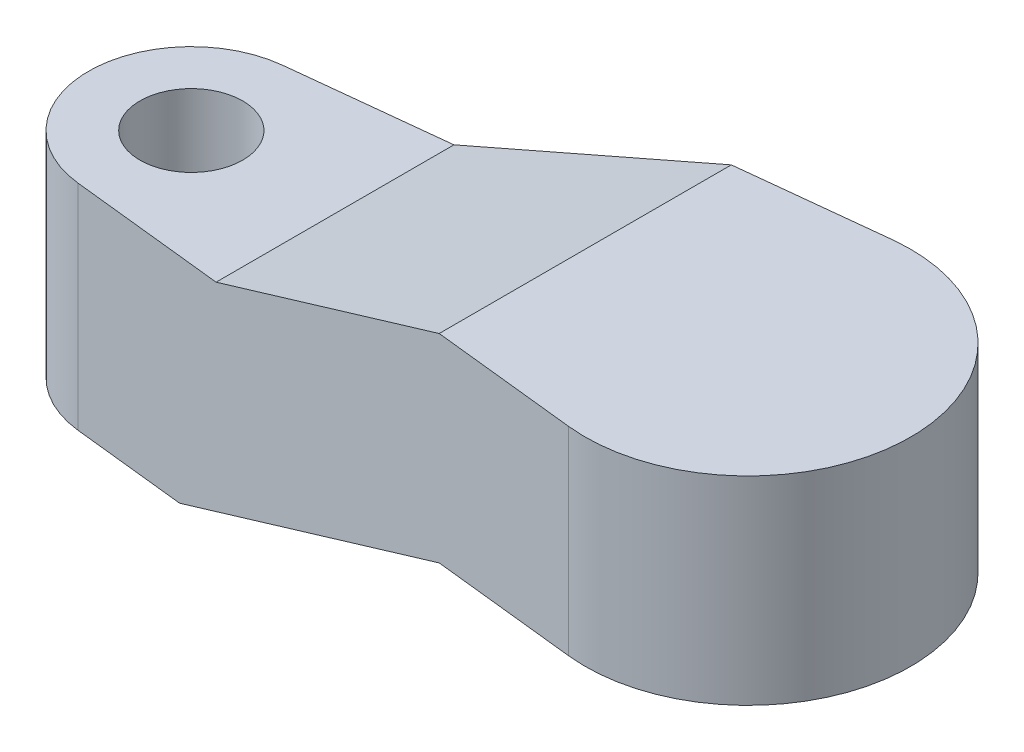
ISO-10303-21;
HEADER;
FILE_DESCRIPTION(('STEP AP214'),'2;1');
FILE_NAME('part.step','',(''),(''),'','','');
FILE_SCHEMA(('AUTOMOTIVE_DESIGN { 1 0 10303 214 1 1 1 1 }'));
ENDSEC;
DATA;
#1=APPLICATION_CONTEXT('core data for automotive mechanical design processes');
#2=APPLICATION_PROTOCOL_DEFINITION('international standard','automotive_design',2000,#1);
#3=PRODUCT_CONTEXT('',#1,'mechanical');
#4=PRODUCT('Part','Part','',(#3));
#5=PRODUCT_RELATED_PRODUCT_CATEGORY('part','',(#4));
#6=PRODUCT_DEFINITION_FORMATION('','',#4);
#7=PRODUCT_DEFINITION_CONTEXT('part definition',#1,'design');
#8=PRODUCT_DEFINITION('design','',#6,#7);
#9=PRODUCT_DEFINITION_SHAPE('','',#8);
#10=(LENGTH_UNIT() NAMED_UNIT(*) SI_UNIT(.MILLI.,.METRE.));
#11=(NAMED_UNIT(*) PLANE_ANGLE_UNIT() SI_UNIT($,.RADIAN.));
#12=(NAMED_UNIT(*) SI_UNIT($,.STERADIAN.) SOLID_ANGLE_UNIT());
#13=UNCERTAINTY_MEASURE_WITH_UNIT(LENGTH_MEASURE(1.E-05),#10,'distance_accuracy_value','');
#14=(GEOMETRIC_REPRESENTATION_CONTEXT(3) GLOBAL_UNCERTAINTY_ASSIGNED_CONTEXT((#13)) GLOBAL_UNIT_ASSIGNED_CONTEXT((#10,
#11,#12)) REPRESENTATION_CONTEXT('',''));
#15=CARTESIAN_POINT('',(0.,0.,0.));
#16=DIRECTION('',(0.,0.,1.));
#17=DIRECTION('',(1.,0.,0.));
#18=AXIS2_PLACEMENT_3D('',#15,#16,#17);
#19=CARTESIAN_POINT('',(-16.25,9.,0.));
#20=DIRECTION('',(0.,-1.,0.));
#21=DIRECTION('',(0.,0.,-1.));
#22=AXIS2_PLACEMENT_3D('',#19,#20,#21);
#23=CYLINDRICAL_SURFACE('',#22,3.);
#24=CARTESIAN_POINT('',(-16.25,6.25,0.));
#25=DIRECTION('',(0.,-1.,0.));
#26=DIRECTION('',(1.,0.,0.));
#27=AXIS2_PLACEMENT_3D('',#24,#25,#26);
#28=CIRCLE('',#27,3.);
#29=CARTESIAN_POINT('',(-16.5730769230769,6.25,2.98255281625911));
#30=VERTEX_POINT('',#29);
#31=CARTESIAN_POINT('',(-16.5730769230769,6.25,-2.98255281625911));
#32=VERTEX_POINT('',#31);
#33=EDGE_CURVE('E146',#30,#32,#28,.T.);
#34=ORIENTED_EDGE('',*,*,#33,.T.);
#35=DIRECTION('',(0.,-1.,0.));
#36=VECTOR('',#35,1.);
#37=CARTESIAN_POINT('',(-16.5730769230769,9.,-2.98255281625911));
#38=LINE('',#37,#36);
#39=CARTESIAN_POINT('',(-16.5730769230769,0.,-2.98255281625911));
#40=VERTEX_POINT('',#39);
#41=EDGE_CURVE('E129',#32,#40,#38,.T.);
#42=ORIENTED_EDGE('',*,*,#41,.T.);
#43=CARTESIAN_POINT('',(-16.25,0.,0.));
#44=DIRECTION('',(0.,1.,0.));
#45=DIRECTION('',(0.,0.,1.));
#46=AXIS2_PLACEMENT_3D('',#43,#44,#45);
#47=CIRCLE('',#46,3.);
#48=CARTESIAN_POINT('',(-16.5730769230769,0.,2.98255281625911));
#49=VERTEX_POINT('',#48);
#50=EDGE_CURVE('E120',#40,#49,#47,.T.);
#51=ORIENTED_EDGE('',*,*,#50,.T.);
#52=DIRECTION('',(0.,-1.,0.));
#53=VECTOR('',#52,1.);
#54=CARTESIAN_POINT('',(-16.5730769230769,9.,2.98255281625911));
#55=LINE('',#54,#53);
#56=EDGE_CURVE('E137',#30,#49,#55,.T.);
#57=ORIENTED_EDGE('',*,*,#56,.F.);
#58=EDGE_LOOP('',(#34,#42,#51,#57));
#59=FACE_BOUND('',#58,.T.);
#60=ADVANCED_FACE('F34',(#59),#23,.T.);
#61=CARTESIAN_POINT('',(-16.5730769230769,9.,2.98255281625911));
#62=DIRECTION('',(0.107692307692308,0.,-0.99418427208637));
#63=DIRECTION('',(-0.99418427208637,0.,-0.107692307692308));
#64=AXIS2_PLACEMENT_3D('',#61,#62,#63);
#65=PLANE('',#64);
#66=DIRECTION('',(0.99418427208637,0.,0.107692307692308));
#67=VECTOR('',#66,1.);
#68=CARTESIAN_POINT('',(-16.5730769230769,0.,2.98255281625911));
#69=LINE('',#68,#67);
#70=CARTESIAN_POINT('',(-13.25,0.,3.34251608718693));
#71=VERTEX_POINT('',#70);
#72=EDGE_CURVE('E122',#49,#71,#69,.T.);
#73=ORIENTED_EDGE('',*,*,#72,.T.);
#74=DIRECTION('',(0.931103612303157,0.350533124631777,0.10085926676263));
#75=VECTOR('',#74,1.);
#76=CARTESIAN_POINT('',(-13.2273149984071,0.0085402358937902,3.34497337829496));
#77=LINE('',#76,#75);
#78=CARTESIAN_POINT('',(-4.75,3.2,4.26325547231481));
#79=VERTEX_POINT('',#78);
#80=EDGE_CURVE('E49',#71,#79,#77,.T.);
#81=ORIENTED_EDGE('',*,*,#80,.T.);
#82=DIRECTION('',(0.99418427208637,0.,0.107692307692308));
#83=VECTOR('',#82,1.);
#84=CARTESIAN_POINT('',(-16.5730769230769,3.2,2.98255281625911));
#85=LINE('',#84,#83);
#86=CARTESIAN_POINT('',(-0.511538461538459,3.2,4.72237529241026));
#87=VERTEX_POINT('',#86);
#88=EDGE_CURVE('E174',#79,#87,#85,.T.);
#89=ORIENTED_EDGE('',*,*,#88,.T.);
#90=DIRECTION('',(0.,-1.,0.));
#91=VECTOR('',#90,1.);
#92=CARTESIAN_POINT('',(-0.511538461538459,9.,4.72237529241026));
#93=LINE('',#92,#91);
#94=CARTESIAN_POINT('',(-0.511538461538459,9.,4.72237529241026));
#95=VERTEX_POINT('',#94);
#96=EDGE_CURVE('E134',#95,#87,#93,.T.);
#97=ORIENTED_EDGE('',*,*,#96,.F.);
#98=DIRECTION('',(0.99418427208637,0.,0.107692307692308));
#99=VECTOR('',#98,1.);
#100=CARTESIAN_POINT('',(-16.5730769230769,9.,2.98255281625911));
#101=LINE('',#100,#99);
#102=CARTESIAN_POINT('',(-4.75,9.,4.26325547231481));
#103=VERTEX_POINT('',#102);
#104=EDGE_CURVE('E121',#103,#95,#101,.T.);
#105=ORIENTED_EDGE('',*,*,#104,.F.);
#106=DIRECTION('',(-0.931103612303157,-0.350533124631777,-0.10085926676263));
#107=VECTOR('',#106,1.);
#108=CARTESIAN_POINT('',(-15.1203344181512,5.09587410140191,3.13991719752199));
#109=LINE('',#108,#107);
#110=CARTESIAN_POINT('',(-12.0546875,6.25,3.47199506322054));
#111=VERTEX_POINT('',#110);
#112=EDGE_CURVE('E57',#103,#111,#109,.T.);
#113=ORIENTED_EDGE('',*,*,#112,.T.);
#114=DIRECTION('',(-0.99418427208637,0.,-0.107692307692308));
#115=VECTOR('',#114,1.);
#116=CARTESIAN_POINT('',(-16.5730769230769,6.25,2.98255281625911));
#117=LINE('',#116,#115);
#118=EDGE_CURVE('E152',#111,#30,#117,.T.);
#119=ORIENTED_EDGE('',*,*,#118,.T.);
#120=ORIENTED_EDGE('',*,*,#56,.T.);
#121=EDGE_LOOP('',(#73,#81,#89,#97,#105,#113,#119,#120));
#122=FACE_BOUND('',#121,.T.);
#123=ADVANCED_FACE('F173',(#122),#65,.F.);
#124=CARTESIAN_POINT('',(0.,9.,0.));
#125=DIRECTION('',(0.,-1.,0.));
#126=DIRECTION('',(0.,0.,-1.));
#127=AXIS2_PLACEMENT_3D('',#124,#125,#126);
#128=CYLINDRICAL_SURFACE('',#127,4.75);
#129=ORIENTED_EDGE('',*,*,#96,.T.);
#130=CARTESIAN_POINT('',(0.,3.2,0.));
#131=DIRECTION('',(0.,1.,0.));
#132=DIRECTION('',(0.,0.,1.));
#133=AXIS2_PLACEMENT_3D('',#130,#131,#132);
#134=CIRCLE('',#133,4.75);
#135=CARTESIAN_POINT('',(-0.511538461538463,3.2,-4.72237529241026));
#136=VERTEX_POINT('',#135);
#137=EDGE_CURVE('E167',#136,#87,#134,.F.);
#138=ORIENTED_EDGE('',*,*,#137,.F.);
#139=DIRECTION('',(0.,-1.,0.));
#140=VECTOR('',#139,1.);
#141=CARTESIAN_POINT('',(-0.511538461538461,9.,-4.72237529241026));
#142=LINE('',#141,#140);
#143=CARTESIAN_POINT('',(-0.511538461538461,9.,-4.72237529241026));
#144=VERTEX_POINT('',#143);
#145=EDGE_CURVE('E131',#144,#136,#142,.T.);
#146=ORIENTED_EDGE('',*,*,#145,.F.);
#147=CARTESIAN_POINT('',(0.,9.,0.));
#148=DIRECTION('',(0.,-1.,0.));
#149=DIRECTION('',(0.,0.,-1.));
#150=AXIS2_PLACEMENT_3D('',#147,#148,#149);
#151=CIRCLE('',#150,4.75);
#152=EDGE_CURVE('E124',#144,#95,#151,.T.);
#153=ORIENTED_EDGE('',*,*,#152,.T.);
#154=EDGE_LOOP('',(#129,#138,#146,#153));
#155=FACE_BOUND('',#154,.T.);
#156=ADVANCED_FACE('F166',(#155),#128,.T.);
#157=CARTESIAN_POINT('',(-16.5730769230769,9.,-2.98255281625911));
#158=DIRECTION('',(-0.107692307692308,0.,-0.99418427208637));
#159=DIRECTION('',(-0.99418427208637,0.,0.107692307692308));
#160=AXIS2_PLACEMENT_3D('',#157,#158,#159);
#161=PLANE('',#160);
#162=DIRECTION('',(0.931103612303157,0.350533124631777,-0.10085926676263));
#163=VECTOR('',#162,1.);
#164=CARTESIAN_POINT('',(-13.2273149984071,0.0085402358937902,-3.34497337829496));
#165=LINE('',#164,#163);
#166=CARTESIAN_POINT('',(-13.25,0.,-3.34251608718693));
#167=VERTEX_POINT('',#166);
#168=CARTESIAN_POINT('',(-4.75,3.2,-4.26325547231481));
#169=VERTEX_POINT('',#168);
#170=EDGE_CURVE('E100',#167,#169,#165,.T.);
#171=ORIENTED_EDGE('',*,*,#170,.F.);
#172=DIRECTION('',(0.99418427208637,0.,-0.107692307692308));
#173=VECTOR('',#172,1.);
#174=CARTESIAN_POINT('',(-16.5730769230769,0.,-2.98255281625911));
#175=LINE('',#174,#173);
#176=EDGE_CURVE('E113',#40,#167,#175,.T.);
#177=ORIENTED_EDGE('',*,*,#176,.F.);
#178=ORIENTED_EDGE('',*,*,#41,.F.);
#179=DIRECTION('',(-0.99418427208637,0.,0.107692307692308));
#180=VECTOR('',#179,1.);
#181=CARTESIAN_POINT('',(-16.5730769230769,6.25,-2.98255281625911));
#182=LINE('',#181,#180);
#183=CARTESIAN_POINT('',(-12.0546875,6.25,-3.47199506322054));
#184=VERTEX_POINT('',#183);
#185=EDGE_CURVE('E106',#184,#32,#182,.T.);
#186=ORIENTED_EDGE('',*,*,#185,.F.);
#187=DIRECTION('',(-0.931103612303157,-0.350533124631777,0.10085926676263));
#188=VECTOR('',#187,1.);
#189=CARTESIAN_POINT('',(-15.1203344181512,5.09587410140191,-3.13991719752199));
#190=LINE('',#189,#188);
#191=CARTESIAN_POINT('',(-4.75,9.,-4.26325547231481));
#192=VERTEX_POINT('',#191);
#193=EDGE_CURVE('E155',#192,#184,#190,.T.);
#194=ORIENTED_EDGE('',*,*,#193,.F.);
#195=DIRECTION('',(0.99418427208637,0.,-0.107692307692308));
#196=VECTOR('',#195,1.);
#197=CARTESIAN_POINT('',(-16.5730769230769,9.,-2.98255281625911));
#198=LINE('',#197,#196);
#199=EDGE_CURVE('E132',#192,#144,#198,.T.);
#200=ORIENTED_EDGE('',*,*,#199,.T.);
#201=ORIENTED_EDGE('',*,*,#145,.T.);
#202=DIRECTION('',(0.99418427208637,0.,-0.107692307692308));
#203=VECTOR('',#202,1.);
#204=CARTESIAN_POINT('',(-16.5730769230769,3.2,-2.98255281625911));
#205=LINE('',#204,#203);
#206=EDGE_CURVE('E11',#169,#136,#205,.T.);
#207=ORIENTED_EDGE('',*,*,#206,.F.);
#208=EDGE_LOOP('',(#171,#177,#178,#186,#194,#200,#201,#207));
#209=FACE_BOUND('',#208,.T.);
#210=ADVANCED_FACE('F111',(#209),#161,.T.);
#211=CARTESIAN_POINT('',(-16.25,9.,0.));
#212=DIRECTION('',(0.,1.,0.));
#213=DIRECTION('',(0.,0.,1.));
#214=AXIS2_PLACEMENT_3D('',#211,#212,#213);
#215=PLANE('',#214);
#216=DIRECTION('',(0.,0.,-1.));
#217=VECTOR('',#216,1.);
#218=CARTESIAN_POINT('',(-4.75,9.,0.));
#219=LINE('',#218,#217);
#220=EDGE_CURVE('E139',#103,#192,#219,.T.);
#221=ORIENTED_EDGE('',*,*,#220,.F.);
#222=ORIENTED_EDGE('',*,*,#104,.T.);
#223=ORIENTED_EDGE('',*,*,#152,.F.);
#224=ORIENTED_EDGE('',*,*,#199,.F.);
#225=EDGE_LOOP('',(#221,#222,#223,#224));
#226=FACE_BOUND('',#225,.T.);
#227=ADVANCED_FACE('F168',(#226),#215,.T.);
#228=CARTESIAN_POINT('',(-16.25,0.,0.));
#229=DIRECTION('',(0.,1.,0.));
#230=DIRECTION('',(0.,0.,1.));
#231=AXIS2_PLACEMENT_3D('',#228,#229,#230);
#232=PLANE('',#231);
#233=CARTESIAN_POINT('',(-16.25,0.,0.));
#234=DIRECTION('',(0.,-1.,0.));
#235=DIRECTION('',(0.,0.,-1.));
#236=AXIS2_PLACEMENT_3D('',#233,#234,#235);
#237=CIRCLE('',#236,1.5);
#238=CARTESIAN_POINT('',(-16.25,0.,-1.5));
#239=VERTEX_POINT('',#238);
#240=EDGE_CURVE('E283',#239,#239,#237,.T.);
#241=ORIENTED_EDGE('',*,*,#240,.F.);
#242=EDGE_LOOP('',(#241));
#243=FACE_BOUND('',#242,.T.);
#244=ORIENTED_EDGE('',*,*,#176,.T.);
#245=DIRECTION('',(0.,0.,1.));
#246=VECTOR('',#245,1.);
#247=CARTESIAN_POINT('',(-13.25,0.,0.));
#248=LINE('',#247,#246);
#249=EDGE_CURVE('E42',#167,#71,#248,.T.);
#250=ORIENTED_EDGE('',*,*,#249,.T.);
#251=ORIENTED_EDGE('',*,*,#72,.F.);
#252=ORIENTED_EDGE('',*,*,#50,.F.);
#253=EDGE_LOOP('',(#244,#250,#251,#252));
#254=FACE_BOUND('',#253,.T.);
#255=ADVANCED_FACE('F118',(#243,#254),#232,.F.);
#256=CARTESIAN_POINT('',(-12.0546875,6.25,-4.75));
#257=DIRECTION('',(0.,-1.,0.));
#258=DIRECTION('',(1.,0.,0.));
#259=AXIS2_PLACEMENT_3D('',#256,#257,#258);
#260=PLANE('',#259);
#261=CARTESIAN_POINT('',(-16.25,6.25,0.));
#262=DIRECTION('',(0.,-1.,0.));
#263=DIRECTION('',(1.,0.,0.));
#264=AXIS2_PLACEMENT_3D('',#261,#262,#263);
#265=CIRCLE('',#264,1.5);
#266=CARTESIAN_POINT('',(-14.75,6.25,0.));
#267=VERTEX_POINT('',#266);
#268=EDGE_CURVE('E37',#267,#267,#265,.T.);
#269=ORIENTED_EDGE('',*,*,#268,.T.);
#270=EDGE_LOOP('',(#269));
#271=FACE_BOUND('',#270,.T.);
#272=DIRECTION('',(0.,0.,1.));
#273=VECTOR('',#272,1.);
#274=CARTESIAN_POINT('',(-12.0546875,6.25,-4.75));
#275=LINE('',#274,#273);
#276=EDGE_CURVE('E148',#184,#111,#275,.T.);
#277=ORIENTED_EDGE('',*,*,#276,.F.);
#278=ORIENTED_EDGE('',*,*,#185,.T.);
#279=ORIENTED_EDGE('',*,*,#33,.F.);
#280=ORIENTED_EDGE('',*,*,#118,.F.);
#281=EDGE_LOOP('',(#277,#278,#279,#280));
#282=FACE_BOUND('',#281,.T.);
#283=ADVANCED_FACE('F145',(#271,#282),#260,.F.);
#284=CARTESIAN_POINT('',(-4.75,9.,-4.75));
#285=DIRECTION('',(0.352329758806261,-0.935875921829129,0.));
#286=DIRECTION('',(0.935875921829129,0.352329758806261,0.));
#287=AXIS2_PLACEMENT_3D('',#284,#285,#286);
#288=PLANE('',#287);
#289=ORIENTED_EDGE('',*,*,#220,.T.);
#290=ORIENTED_EDGE('',*,*,#193,.T.);
#291=ORIENTED_EDGE('',*,*,#276,.T.);
#292=ORIENTED_EDGE('',*,*,#112,.F.);
#293=EDGE_LOOP('',(#289,#290,#291,#292));
#294=FACE_BOUND('',#293,.T.);
#295=ADVANCED_FACE('F180',(#294),#288,.F.);
#296=CARTESIAN_POINT('',(-4.75,3.2,-4.75));
#297=DIRECTION('',(0.,1.,0.));
#298=DIRECTION('',(0.,0.,1.));
#299=AXIS2_PLACEMENT_3D('',#296,#297,#298);
#300=PLANE('',#299);
#301=CARTESIAN_POINT('',(0.,3.2,0.));
#302=DIRECTION('',(0.,-1.,0.));
#303=DIRECTION('',(0.,0.,-1.));
#304=AXIS2_PLACEMENT_3D('',#301,#302,#303);
#305=CIRCLE('',#304,2.);
#306=CARTESIAN_POINT('',(0.,3.2,-2.));
#307=VERTEX_POINT('',#306);
#308=EDGE_CURVE('E279',#307,#307,#305,.T.);
#309=ORIENTED_EDGE('',*,*,#308,.F.);
#310=EDGE_LOOP('',(#309));
#311=FACE_BOUND('',#310,.T.);
#312=DIRECTION('',(0.,0.,1.));
#313=VECTOR('',#312,1.);
#314=CARTESIAN_POINT('',(-4.75,3.2,-4.75));
#315=LINE('',#314,#313);
#316=EDGE_CURVE('E115',#169,#79,#315,.T.);
#317=ORIENTED_EDGE('',*,*,#316,.F.);
#318=ORIENTED_EDGE('',*,*,#206,.T.);
#319=ORIENTED_EDGE('',*,*,#137,.T.);
#320=ORIENTED_EDGE('',*,*,#88,.F.);
#321=EDGE_LOOP('',(#317,#318,#319,#320));
#322=FACE_BOUND('',#321,.T.);
#323=ADVANCED_FACE('F182',(#311,#322),#300,.F.);
#324=CARTESIAN_POINT('',(-13.25,0.,-4.75));
#325=DIRECTION('',(-0.35232975880626,0.935875921829129,0.));
#326=DIRECTION('',(-0.935875921829129,-0.35232975880626,0.));
#327=AXIS2_PLACEMENT_3D('',#324,#325,#326);
#328=PLANE('',#327);
#329=ORIENTED_EDGE('',*,*,#249,.F.);
#330=ORIENTED_EDGE('',*,*,#170,.T.);
#331=ORIENTED_EDGE('',*,*,#316,.T.);
#332=ORIENTED_EDGE('',*,*,#80,.F.);
#333=EDGE_LOOP('',(#329,#330,#331,#332));
#334=FACE_BOUND('',#333,.T.);
#335=ADVANCED_FACE('F99',(#334),#328,.F.);
#336=CARTESIAN_POINT('',(0.,5.2,0.));
#337=DIRECTION('',(0.,-1.,0.));
#338=DIRECTION('',(0.,0.,-1.));
#339=AXIS2_PLACEMENT_3D('',#336,#337,#338);
#340=CYLINDRICAL_SURFACE('',#339,2.);
#341=CARTESIAN_POINT('',(0.,5.2,0.));
#342=DIRECTION('',(0.,-1.,0.));
#343=DIRECTION('',(0.,0.,-1.));
#344=AXIS2_PLACEMENT_3D('',#341,#342,#343);
#345=CIRCLE('',#344,2.);
#346=CARTESIAN_POINT('',(0.,5.2,-2.));
#347=VERTEX_POINT('',#346);
#348=EDGE_CURVE('E276',#347,#347,#345,.T.);
#349=ORIENTED_EDGE('',*,*,#348,.F.);
#350=EDGE_LOOP('',(#349));
#351=FACE_BOUND('',#350,.T.);
#352=ORIENTED_EDGE('',*,*,#308,.T.);
#353=EDGE_LOOP('',(#352));
#354=FACE_BOUND('',#353,.T.);
#355=ADVANCED_FACE('F240',(#351,#354),#340,.F.);
#356=CARTESIAN_POINT('',(0.,5.2,0.));
#357=DIRECTION('',(0.,-1.,0.));
#358=DIRECTION('',(0.,0.,-1.));
#359=AXIS2_PLACEMENT_3D('',#356,#357,#358);
#360=PLANE('',#359);
#361=ORIENTED_EDGE('',*,*,#348,.T.);
#362=EDGE_LOOP('',(#361));
#363=FACE_BOUND('',#362,.T.);
#364=ADVANCED_FACE('F230',(#363),#360,.T.);
#365=CARTESIAN_POINT('',(-16.25,9.,0.));
#366=DIRECTION('',(0.,-1.,0.));
#367=DIRECTION('',(0.,0.,-1.));
#368=AXIS2_PLACEMENT_3D('',#365,#366,#367);
#369=CYLINDRICAL_SURFACE('',#368,1.5);
#370=ORIENTED_EDGE('',*,*,#240,.T.);
#371=EDGE_LOOP('',(#370));
#372=FACE_BOUND('',#371,.T.);
#373=ORIENTED_EDGE('',*,*,#268,.F.);
#374=EDGE_LOOP('',(#373));
#375=FACE_BOUND('',#374,.T.);
#376=ADVANCED_FACE('F226',(#372,#375),#369,.F.);
#377=CLOSED_SHELL('',(#60,#123,#156,#210,#227,#255,#283,#295,#323,#335,#355,#364,#376));
#378=MANIFOLD_SOLID_BREP('B2',#377);
#379=ADVANCED_BREP_SHAPE_REPRESENTATION('',(#18,#378),#14);
#380=SHAPE_DEFINITION_REPRESENTATION(#9,#379);
ENDSEC;
END-ISO-10303-21;
